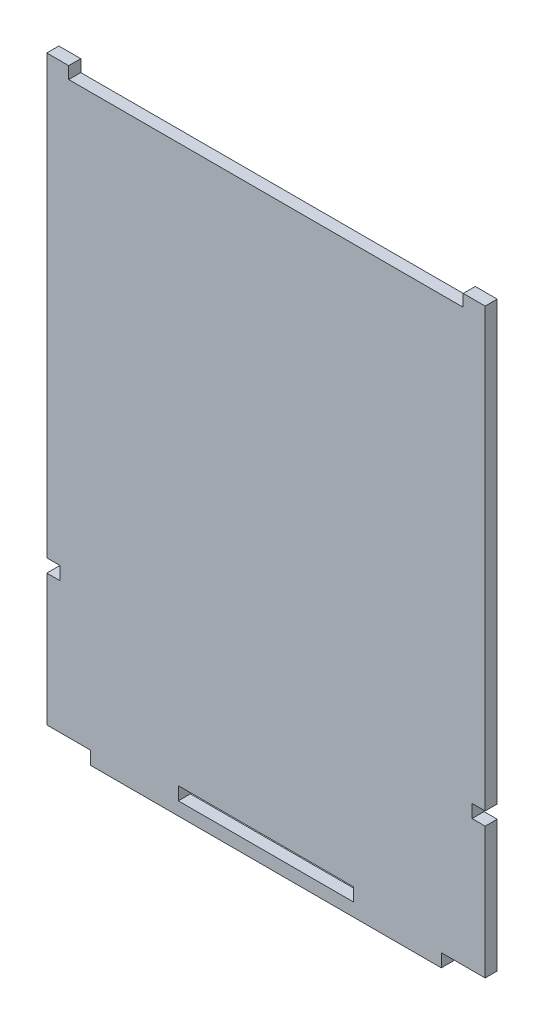
ISO-10303-21;
HEADER;
FILE_DESCRIPTION(('STEP AP214'),'2;1');
FILE_NAME('part.step','',(''),(''),'','','');
FILE_SCHEMA(('AUTOMOTIVE_DESIGN { 1 0 10303 214 1 1 1 1 }'));
ENDSEC;
DATA;
#1=APPLICATION_CONTEXT('core data for automotive mechanical design processes');
#2=APPLICATION_PROTOCOL_DEFINITION('international standard','automotive_design',2000,#1);
#3=PRODUCT_CONTEXT('',#1,'mechanical');
#4=PRODUCT('Part','Part','',(#3));
#5=PRODUCT_RELATED_PRODUCT_CATEGORY('part','',(#4));
#6=PRODUCT_DEFINITION_FORMATION('','',#4);
#7=PRODUCT_DEFINITION_CONTEXT('part definition',#1,'design');
#8=PRODUCT_DEFINITION('design','',#6,#7);
#9=PRODUCT_DEFINITION_SHAPE('','',#8);
#10=(LENGTH_UNIT() NAMED_UNIT(*) SI_UNIT(.MILLI.,.METRE.));
#11=(NAMED_UNIT(*) PLANE_ANGLE_UNIT() SI_UNIT($,.RADIAN.));
#12=(NAMED_UNIT(*) SI_UNIT($,.STERADIAN.) SOLID_ANGLE_UNIT());
#13=UNCERTAINTY_MEASURE_WITH_UNIT(LENGTH_MEASURE(1.E-05),#10,'distance_accuracy_value','');
#14=(GEOMETRIC_REPRESENTATION_CONTEXT(3) GLOBAL_UNCERTAINTY_ASSIGNED_CONTEXT((#13)) GLOBAL_UNIT_ASSIGNED_CONTEXT((#10,
#11,#12)) REPRESENTATION_CONTEXT('',''));
#15=CARTESIAN_POINT('',(0.,0.,0.));
#16=DIRECTION('',(0.,0.,1.));
#17=DIRECTION('',(1.,0.,0.));
#18=AXIS2_PLACEMENT_3D('',#15,#16,#17);
#19=CARTESIAN_POINT('',(70.,0.,2.75));
#20=DIRECTION('',(1.,0.,0.));
#21=DIRECTION('',(0.,0.,-1.));
#22=AXIS2_PLACEMENT_3D('',#19,#20,#21);
#23=PLANE('',#22);
#24=DIRECTION('',(0.,-1.,0.));
#25=VECTOR('',#24,1.);
#26=CARTESIAN_POINT('',(70.,0.,0.));
#27=LINE('',#26,#25);
#28=CARTESIAN_POINT('',(70.,-27.,0.));
#29=VERTEX_POINT('',#28);
#30=CARTESIAN_POINT('',(70.,-30.,0.));
#31=VERTEX_POINT('',#30);
#32=EDGE_CURVE('E280',#29,#31,#27,.T.);
#33=ORIENTED_EDGE('',*,*,#32,.T.);
#34=DIRECTION('',(0.,0.,-1.));
#35=VECTOR('',#34,1.);
#36=CARTESIAN_POINT('',(70.,-30.,2.75));
#37=LINE('',#36,#35);
#38=CARTESIAN_POINT('',(70.,-30.,2.75));
#39=VERTEX_POINT('',#38);
#40=EDGE_CURVE('E11',#39,#31,#37,.T.);
#41=ORIENTED_EDGE('',*,*,#40,.F.);
#42=DIRECTION('',(0.,-1.,0.));
#43=VECTOR('',#42,1.);
#44=CARTESIAN_POINT('',(70.,0.,2.75));
#45=LINE('',#44,#43);
#46=CARTESIAN_POINT('',(70.,-27.,2.75));
#47=VERTEX_POINT('',#46);
#48=EDGE_CURVE('E217',#47,#39,#45,.T.);
#49=ORIENTED_EDGE('',*,*,#48,.F.);
#50=DIRECTION('',(0.,0.,-1.));
#51=VECTOR('',#50,1.);
#52=CARTESIAN_POINT('',(70.,-27.,2.75));
#53=LINE('',#52,#51);
#54=EDGE_CURVE('E54',#47,#29,#53,.T.);
#55=ORIENTED_EDGE('',*,*,#54,.T.);
#56=EDGE_LOOP('',(#33,#41,#49,#55));
#57=FACE_BOUND('',#56,.T.);
#58=ADVANCED_FACE('F35',(#57),#23,.F.);
#59=CARTESIAN_POINT('',(0.,-30.,2.75));
#60=DIRECTION('',(0.,1.,0.));
#61=DIRECTION('',(0.,0.,1.));
#62=AXIS2_PLACEMENT_3D('',#59,#60,#61);
#63=PLANE('',#62);
#64=DIRECTION('',(1.,0.,0.));
#65=VECTOR('',#64,1.);
#66=CARTESIAN_POINT('',(0.,-30.,0.));
#67=LINE('',#66,#65);
#68=CARTESIAN_POINT('',(30.,-30.,0.));
#69=VERTEX_POINT('',#68);
#70=EDGE_CURVE('E207',#69,#31,#67,.T.);
#71=ORIENTED_EDGE('',*,*,#70,.F.);
#72=DIRECTION('',(0.,0.,-1.));
#73=VECTOR('',#72,1.);
#74=CARTESIAN_POINT('',(30.,-30.,2.75));
#75=LINE('',#74,#73);
#76=CARTESIAN_POINT('',(30.,-30.,2.75));
#77=VERTEX_POINT('',#76);
#78=EDGE_CURVE('E45',#77,#69,#75,.T.);
#79=ORIENTED_EDGE('',*,*,#78,.F.);
#80=DIRECTION('',(1.,0.,0.));
#81=VECTOR('',#80,1.);
#82=CARTESIAN_POINT('',(0.,-30.,2.75));
#83=LINE('',#82,#81);
#84=EDGE_CURVE('E205',#77,#39,#83,.T.);
#85=ORIENTED_EDGE('',*,*,#84,.T.);
#86=ORIENTED_EDGE('',*,*,#40,.T.);
#87=EDGE_LOOP('',(#71,#79,#85,#86));
#88=FACE_BOUND('',#87,.T.);
#89=ADVANCED_FACE('F204',(#88),#63,.T.);
#90=CARTESIAN_POINT('',(30.,0.,2.75));
#91=DIRECTION('',(1.,0.,0.));
#92=DIRECTION('',(0.,0.,-1.));
#93=AXIS2_PLACEMENT_3D('',#90,#91,#92);
#94=PLANE('',#93);
#95=DIRECTION('',(0.,-1.,0.));
#96=VECTOR('',#95,1.);
#97=CARTESIAN_POINT('',(30.,0.,0.));
#98=LINE('',#97,#96);
#99=CARTESIAN_POINT('',(30.,-27.,0.));
#100=VERTEX_POINT('',#99);
#101=EDGE_CURVE('E283',#100,#69,#98,.T.);
#102=ORIENTED_EDGE('',*,*,#101,.F.);
#103=DIRECTION('',(0.,0.,-1.));
#104=VECTOR('',#103,1.);
#105=CARTESIAN_POINT('',(30.,-27.,2.75));
#106=LINE('',#105,#104);
#107=CARTESIAN_POINT('',(30.,-27.,2.75));
#108=VERTEX_POINT('',#107);
#109=EDGE_CURVE('E127',#108,#100,#106,.T.);
#110=ORIENTED_EDGE('',*,*,#109,.F.);
#111=DIRECTION('',(0.,-1.,0.));
#112=VECTOR('',#111,1.);
#113=CARTESIAN_POINT('',(30.,0.,2.75));
#114=LINE('',#113,#112);
#115=EDGE_CURVE('E216',#108,#77,#114,.T.);
#116=ORIENTED_EDGE('',*,*,#115,.T.);
#117=ORIENTED_EDGE('',*,*,#78,.T.);
#118=EDGE_LOOP('',(#102,#110,#116,#117));
#119=FACE_BOUND('',#118,.T.);
#120=ADVANCED_FACE('F220',(#119),#94,.T.);
#121=CARTESIAN_POINT('',(90.,0.,2.75));
#122=DIRECTION('',(1.,0.,0.));
#123=DIRECTION('',(0.,0.,-1.));
#124=AXIS2_PLACEMENT_3D('',#121,#122,#123);
#125=PLANE('',#124);
#126=DIRECTION('',(0.,-1.,0.));
#127=VECTOR('',#126,1.);
#128=CARTESIAN_POINT('',(90.,0.,0.));
#129=LINE('',#128,#127);
#130=CARTESIAN_POINT('',(90.,-30.,0.));
#131=VERTEX_POINT('',#130);
#132=CARTESIAN_POINT('',(90.,-33.,0.));
#133=VERTEX_POINT('',#132);
#134=EDGE_CURVE('E227',#131,#133,#129,.T.);
#135=ORIENTED_EDGE('',*,*,#134,.F.);
#136=DIRECTION('',(0.,0.,-1.));
#137=VECTOR('',#136,1.);
#138=CARTESIAN_POINT('',(90.,-30.,2.75));
#139=LINE('',#138,#137);
#140=CARTESIAN_POINT('',(90.,-30.,2.75));
#141=VERTEX_POINT('',#140);
#142=EDGE_CURVE('E39',#141,#131,#139,.T.);
#143=ORIENTED_EDGE('',*,*,#142,.F.);
#144=DIRECTION('',(0.,-1.,0.));
#145=VECTOR('',#144,1.);
#146=CARTESIAN_POINT('',(90.,0.,2.75));
#147=LINE('',#146,#145);
#148=CARTESIAN_POINT('',(90.,-33.,2.75));
#149=VERTEX_POINT('',#148);
#150=EDGE_CURVE('E288',#141,#149,#147,.T.);
#151=ORIENTED_EDGE('',*,*,#150,.T.);
#152=DIRECTION('',(0.,0.,-1.));
#153=VECTOR('',#152,1.);
#154=CARTESIAN_POINT('',(90.,-33.,2.75));
#155=LINE('',#154,#153);
#156=EDGE_CURVE('E223',#149,#133,#155,.T.);
#157=ORIENTED_EDGE('',*,*,#156,.T.);
#158=EDGE_LOOP('',(#135,#143,#151,#157));
#159=FACE_BOUND('',#158,.T.);
#160=ADVANCED_FACE('F37',(#159),#125,.T.);
#161=CARTESIAN_POINT('',(0.,-30.,2.75));
#162=DIRECTION('',(0.,1.,0.));
#163=DIRECTION('',(0.,0.,1.));
#164=AXIS2_PLACEMENT_3D('',#161,#162,#163);
#165=PLANE('',#164);
#166=DIRECTION('',(1.,0.,0.));
#167=VECTOR('',#166,1.);
#168=CARTESIAN_POINT('',(0.,-30.,0.));
#169=LINE('',#168,#167);
#170=CARTESIAN_POINT('',(100.,-30.,0.));
#171=VERTEX_POINT('',#170);
#172=EDGE_CURVE('E230',#131,#171,#169,.T.);
#173=ORIENTED_EDGE('',*,*,#172,.T.);
#174=DIRECTION('',(0.,0.,-1.));
#175=VECTOR('',#174,1.);
#176=CARTESIAN_POINT('',(100.,-30.,2.75));
#177=LINE('',#176,#175);
#178=CARTESIAN_POINT('',(100.,-30.,2.75));
#179=VERTEX_POINT('',#178);
#180=EDGE_CURVE('E330',#179,#171,#177,.T.);
#181=ORIENTED_EDGE('',*,*,#180,.F.);
#182=DIRECTION('',(1.,0.,0.));
#183=VECTOR('',#182,1.);
#184=CARTESIAN_POINT('',(0.,-30.,2.75));
#185=LINE('',#184,#183);
#186=EDGE_CURVE('E338',#141,#179,#185,.T.);
#187=ORIENTED_EDGE('',*,*,#186,.F.);
#188=ORIENTED_EDGE('',*,*,#142,.T.);
#189=EDGE_LOOP('',(#173,#181,#187,#188));
#190=FACE_BOUND('',#189,.T.);
#191=ADVANCED_FACE('F337',(#190),#165,.F.);
#192=CARTESIAN_POINT('',(100.,0.,2.75));
#193=DIRECTION('',(1.,0.,0.));
#194=DIRECTION('',(0.,0.,-1.));
#195=AXIS2_PLACEMENT_3D('',#192,#193,#194);
#196=PLANE('',#195);
#197=DIRECTION('',(0.,-1.,0.));
#198=VECTOR('',#197,1.);
#199=CARTESIAN_POINT('',(100.,0.,0.));
#200=LINE('',#199,#198);
#201=CARTESIAN_POINT('',(100.,0.,0.));
#202=VERTEX_POINT('',#201);
#203=EDGE_CURVE('E233',#202,#171,#200,.T.);
#204=ORIENTED_EDGE('',*,*,#203,.F.);
#205=DIRECTION('',(0.,0.,-1.));
#206=VECTOR('',#205,1.);
#207=CARTESIAN_POINT('',(100.,0.,2.75));
#208=LINE('',#207,#206);
#209=CARTESIAN_POINT('',(100.,0.,2.75));
#210=VERTEX_POINT('',#209);
#211=EDGE_CURVE('E329',#210,#202,#208,.T.);
#212=ORIENTED_EDGE('',*,*,#211,.F.);
#213=DIRECTION('',(0.,-1.,0.));
#214=VECTOR('',#213,1.);
#215=CARTESIAN_POINT('',(100.,0.,2.75));
#216=LINE('',#215,#214);
#217=EDGE_CURVE('E735',#210,#179,#216,.T.);
#218=ORIENTED_EDGE('',*,*,#217,.T.);
#219=ORIENTED_EDGE('',*,*,#180,.T.);
#220=EDGE_LOOP('',(#204,#212,#218,#219));
#221=FACE_BOUND('',#220,.T.);
#222=ADVANCED_FACE('F439',(#221),#196,.T.);
#223=CARTESIAN_POINT('',(0.,0.,2.75));
#224=DIRECTION('',(0.,1.,0.));
#225=DIRECTION('',(0.,0.,1.));
#226=AXIS2_PLACEMENT_3D('',#223,#224,#225);
#227=PLANE('',#226);
#228=DIRECTION('',(1.,0.,0.));
#229=VECTOR('',#228,1.);
#230=CARTESIAN_POINT('',(0.,0.,0.));
#231=LINE('',#230,#229);
#232=CARTESIAN_POINT('',(97.,0.,0.));
#233=VERTEX_POINT('',#232);
#234=EDGE_CURVE('E236',#233,#202,#231,.T.);
#235=ORIENTED_EDGE('',*,*,#234,.F.);
#236=DIRECTION('',(0.,0.,-1.));
#237=VECTOR('',#236,1.);
#238=CARTESIAN_POINT('',(97.,0.,2.75));
#239=LINE('',#238,#237);
#240=CARTESIAN_POINT('',(97.,0.,2.75));
#241=VERTEX_POINT('',#240);
#242=EDGE_CURVE('E327',#241,#233,#239,.T.);
#243=ORIENTED_EDGE('',*,*,#242,.F.);
#244=DIRECTION('',(1.,0.,0.));
#245=VECTOR('',#244,1.);
#246=CARTESIAN_POINT('',(0.,0.,2.75));
#247=LINE('',#246,#245);
#248=EDGE_CURVE('E437',#241,#210,#247,.T.);
#249=ORIENTED_EDGE('',*,*,#248,.T.);
#250=ORIENTED_EDGE('',*,*,#211,.T.);
#251=EDGE_LOOP('',(#235,#243,#249,#250));
#252=FACE_BOUND('',#251,.T.);
#253=ADVANCED_FACE('F433',(#252),#227,.T.);
#254=CARTESIAN_POINT('',(97.,0.,2.75));
#255=DIRECTION('',(-1.,0.,0.));
#256=DIRECTION('',(0.,0.,1.));
#257=AXIS2_PLACEMENT_3D('',#254,#255,#256);
#258=PLANE('',#257);
#259=DIRECTION('',(0.,1.,0.));
#260=VECTOR('',#259,1.);
#261=CARTESIAN_POINT('',(97.,0.,0.));
#262=LINE('',#261,#260);
#263=CARTESIAN_POINT('',(97.,3.,0.));
#264=VERTEX_POINT('',#263);
#265=EDGE_CURVE('E239',#233,#264,#262,.T.);
#266=ORIENTED_EDGE('',*,*,#265,.T.);
#267=DIRECTION('',(0.,0.,-1.));
#268=VECTOR('',#267,1.);
#269=CARTESIAN_POINT('',(97.,3.,2.75));
#270=LINE('',#269,#268);
#271=CARTESIAN_POINT('',(97.,3.,2.75));
#272=VERTEX_POINT('',#271);
#273=EDGE_CURVE('E325',#272,#264,#270,.T.);
#274=ORIENTED_EDGE('',*,*,#273,.F.);
#275=DIRECTION('',(0.,1.,0.));
#276=VECTOR('',#275,1.);
#277=CARTESIAN_POINT('',(97.,0.,2.75));
#278=LINE('',#277,#276);
#279=EDGE_CURVE('E740',#241,#272,#278,.T.);
#280=ORIENTED_EDGE('',*,*,#279,.F.);
#281=ORIENTED_EDGE('',*,*,#242,.T.);
#282=EDGE_LOOP('',(#266,#274,#280,#281));
#283=FACE_BOUND('',#282,.T.);
#284=ADVANCED_FACE('F446',(#283),#258,.F.);
#285=CARTESIAN_POINT('',(0.,3.,2.75));
#286=DIRECTION('',(0.,-1.,0.));
#287=DIRECTION('',(0.,0.,-1.));
#288=AXIS2_PLACEMENT_3D('',#285,#286,#287);
#289=PLANE('',#288);
#290=DIRECTION('',(-1.,0.,0.));
#291=VECTOR('',#290,1.);
#292=CARTESIAN_POINT('',(0.,3.,0.));
#293=LINE('',#292,#291);
#294=CARTESIAN_POINT('',(100.,3.,0.));
#295=VERTEX_POINT('',#294);
#296=EDGE_CURVE('E243',#295,#264,#293,.T.);
#297=ORIENTED_EDGE('',*,*,#296,.F.);
#298=DIRECTION('',(0.,0.,-1.));
#299=VECTOR('',#298,1.);
#300=CARTESIAN_POINT('',(100.,3.,2.75));
#301=LINE('',#300,#299);
#302=CARTESIAN_POINT('',(100.,3.,2.75));
#303=VERTEX_POINT('',#302);
#304=EDGE_CURVE('E323',#303,#295,#301,.T.);
#305=ORIENTED_EDGE('',*,*,#304,.F.);
#306=DIRECTION('',(-1.,0.,0.));
#307=VECTOR('',#306,1.);
#308=CARTESIAN_POINT('',(0.,3.,2.75));
#309=LINE('',#308,#307);
#310=EDGE_CURVE('E427',#303,#272,#309,.T.);
#311=ORIENTED_EDGE('',*,*,#310,.T.);
#312=ORIENTED_EDGE('',*,*,#273,.T.);
#313=EDGE_LOOP('',(#297,#305,#311,#312));
#314=FACE_BOUND('',#313,.T.);
#315=ADVANCED_FACE('F426',(#314),#289,.T.);
#316=CARTESIAN_POINT('',(100.,0.,2.75));
#317=DIRECTION('',(-1.,0.,0.));
#318=DIRECTION('',(0.,0.,1.));
#319=AXIS2_PLACEMENT_3D('',#316,#317,#318);
#320=PLANE('',#319);
#321=DIRECTION('',(0.,1.,0.));
#322=VECTOR('',#321,1.);
#323=CARTESIAN_POINT('',(100.,0.,0.));
#324=LINE('',#323,#322);
#325=CARTESIAN_POINT('',(100.,102.75,0.));
#326=VERTEX_POINT('',#325);
#327=EDGE_CURVE('E246',#295,#326,#324,.T.);
#328=ORIENTED_EDGE('',*,*,#327,.T.);
#329=DIRECTION('',(0.,0.,-1.));
#330=VECTOR('',#329,1.);
#331=CARTESIAN_POINT('',(100.,102.75,2.75));
#332=LINE('',#331,#330);
#333=CARTESIAN_POINT('',(100.,102.75,2.75));
#334=VERTEX_POINT('',#333);
#335=EDGE_CURVE('E320',#334,#326,#332,.T.);
#336=ORIENTED_EDGE('',*,*,#335,.F.);
#337=DIRECTION('',(0.,1.,0.));
#338=VECTOR('',#337,1.);
#339=CARTESIAN_POINT('',(100.,0.,2.75));
#340=LINE('',#339,#338);
#341=EDGE_CURVE('E422',#303,#334,#340,.T.);
#342=ORIENTED_EDGE('',*,*,#341,.F.);
#343=ORIENTED_EDGE('',*,*,#304,.T.);
#344=EDGE_LOOP('',(#328,#336,#342,#343));
#345=FACE_BOUND('',#344,.T.);
#346=ADVANCED_FACE('F421',(#345),#320,.F.);
#347=CARTESIAN_POINT('',(0.,102.75,2.75));
#348=DIRECTION('',(0.,-1.,0.));
#349=DIRECTION('',(0.,0.,-1.));
#350=AXIS2_PLACEMENT_3D('',#347,#348,#349);
#351=PLANE('',#350);
#352=DIRECTION('',(-1.,0.,0.));
#353=VECTOR('',#352,1.);
#354=CARTESIAN_POINT('',(0.,102.75,0.));
#355=LINE('',#354,#353);
#356=CARTESIAN_POINT('',(95.,102.75,0.));
#357=VERTEX_POINT('',#356);
#358=EDGE_CURVE('E248',#326,#357,#355,.T.);
#359=ORIENTED_EDGE('',*,*,#358,.T.);
#360=DIRECTION('',(0.,0.,-1.));
#361=VECTOR('',#360,1.);
#362=CARTESIAN_POINT('',(95.,102.75,2.75));
#363=LINE('',#362,#361);
#364=CARTESIAN_POINT('',(95.,102.75,2.75));
#365=VERTEX_POINT('',#364);
#366=EDGE_CURVE('E317',#365,#357,#363,.T.);
#367=ORIENTED_EDGE('',*,*,#366,.F.);
#368=DIRECTION('',(-1.,0.,0.));
#369=VECTOR('',#368,1.);
#370=CARTESIAN_POINT('',(0.,102.75,2.75));
#371=LINE('',#370,#369);
#372=EDGE_CURVE('E418',#334,#365,#371,.T.);
#373=ORIENTED_EDGE('',*,*,#372,.F.);
#374=ORIENTED_EDGE('',*,*,#335,.T.);
#375=EDGE_LOOP('',(#359,#367,#373,#374));
#376=FACE_BOUND('',#375,.T.);
#377=ADVANCED_FACE('F415',(#376),#351,.F.);
#378=CARTESIAN_POINT('',(95.,0.,2.75));
#379=DIRECTION('',(1.,0.,0.));
#380=DIRECTION('',(0.,0.,-1.));
#381=AXIS2_PLACEMENT_3D('',#378,#379,#380);
#382=PLANE('',#381);
#383=DIRECTION('',(0.,-1.,0.));
#384=VECTOR('',#383,1.);
#385=CARTESIAN_POINT('',(95.,0.,0.));
#386=LINE('',#385,#384);
#387=CARTESIAN_POINT('',(95.,100.,0.));
#388=VERTEX_POINT('',#387);
#389=EDGE_CURVE('E250',#357,#388,#386,.T.);
#390=ORIENTED_EDGE('',*,*,#389,.T.);
#391=DIRECTION('',(0.,0.,-1.));
#392=VECTOR('',#391,1.);
#393=CARTESIAN_POINT('',(95.,100.,2.75));
#394=LINE('',#393,#392);
#395=CARTESIAN_POINT('',(95.,100.,2.75));
#396=VERTEX_POINT('',#395);
#397=EDGE_CURVE('E315',#396,#388,#394,.T.);
#398=ORIENTED_EDGE('',*,*,#397,.F.);
#399=DIRECTION('',(0.,-1.,0.));
#400=VECTOR('',#399,1.);
#401=CARTESIAN_POINT('',(95.,0.,2.75));
#402=LINE('',#401,#400);
#403=EDGE_CURVE('E745',#365,#396,#402,.T.);
#404=ORIENTED_EDGE('',*,*,#403,.F.);
#405=ORIENTED_EDGE('',*,*,#366,.T.);
#406=EDGE_LOOP('',(#390,#398,#404,#405));
#407=FACE_BOUND('',#406,.T.);
#408=ADVANCED_FACE('F409',(#407),#382,.F.);
#409=CARTESIAN_POINT('',(0.,100.,2.75));
#410=DIRECTION('',(0.,1.,0.));
#411=DIRECTION('',(0.,0.,1.));
#412=AXIS2_PLACEMENT_3D('',#409,#410,#411);
#413=PLANE('',#412);
#414=DIRECTION('',(1.,0.,0.));
#415=VECTOR('',#414,1.);
#416=CARTESIAN_POINT('',(0.,100.,0.));
#417=LINE('',#416,#415);
#418=CARTESIAN_POINT('',(5.,100.,0.));
#419=VERTEX_POINT('',#418);
#420=EDGE_CURVE('E253',#419,#388,#417,.T.);
#421=ORIENTED_EDGE('',*,*,#420,.F.);
#422=DIRECTION('',(0.,0.,-1.));
#423=VECTOR('',#422,1.);
#424=CARTESIAN_POINT('',(5.,100.,2.75));
#425=LINE('',#424,#423);
#426=CARTESIAN_POINT('',(5.,100.,2.75));
#427=VERTEX_POINT('',#426);
#428=EDGE_CURVE('E313',#427,#419,#425,.T.);
#429=ORIENTED_EDGE('',*,*,#428,.F.);
#430=DIRECTION('',(1.,0.,0.));
#431=VECTOR('',#430,1.);
#432=CARTESIAN_POINT('',(0.,100.,2.75));
#433=LINE('',#432,#431);
#434=EDGE_CURVE('E406',#427,#396,#433,.T.);
#435=ORIENTED_EDGE('',*,*,#434,.T.);
#436=ORIENTED_EDGE('',*,*,#397,.T.);
#437=EDGE_LOOP('',(#421,#429,#435,#436));
#438=FACE_BOUND('',#437,.T.);
#439=ADVANCED_FACE('F404',(#438),#413,.T.);
#440=CARTESIAN_POINT('',(5.,0.,2.75));
#441=DIRECTION('',(1.,0.,0.));
#442=DIRECTION('',(0.,0.,-1.));
#443=AXIS2_PLACEMENT_3D('',#440,#441,#442);
#444=PLANE('',#443);
#445=DIRECTION('',(0.,-1.,0.));
#446=VECTOR('',#445,1.);
#447=CARTESIAN_POINT('',(5.,0.,0.));
#448=LINE('',#447,#446);
#449=CARTESIAN_POINT('',(5.,102.75,0.));
#450=VERTEX_POINT('',#449);
#451=EDGE_CURVE('E256',#450,#419,#448,.T.);
#452=ORIENTED_EDGE('',*,*,#451,.F.);
#453=DIRECTION('',(0.,0.,-1.));
#454=VECTOR('',#453,1.);
#455=CARTESIAN_POINT('',(5.,102.75,2.75));
#456=LINE('',#455,#454);
#457=CARTESIAN_POINT('',(5.,102.75,2.75));
#458=VERTEX_POINT('',#457);
#459=EDGE_CURVE('E311',#458,#450,#456,.T.);
#460=ORIENTED_EDGE('',*,*,#459,.F.);
#461=DIRECTION('',(0.,-1.,0.));
#462=VECTOR('',#461,1.);
#463=CARTESIAN_POINT('',(5.,0.,2.75));
#464=LINE('',#463,#462);
#465=EDGE_CURVE('E400',#458,#427,#464,.T.);
#466=ORIENTED_EDGE('',*,*,#465,.T.);
#467=ORIENTED_EDGE('',*,*,#428,.T.);
#468=EDGE_LOOP('',(#452,#460,#466,#467));
#469=FACE_BOUND('',#468,.T.);
#470=ADVANCED_FACE('F397',(#469),#444,.T.);
#471=CARTESIAN_POINT('',(0.,102.75,2.75));
#472=DIRECTION('',(0.,1.,0.));
#473=DIRECTION('',(0.,0.,1.));
#474=AXIS2_PLACEMENT_3D('',#471,#472,#473);
#475=PLANE('',#474);
#476=DIRECTION('',(1.,0.,0.));
#477=VECTOR('',#476,1.);
#478=CARTESIAN_POINT('',(0.,102.75,0.));
#479=LINE('',#478,#477);
#480=CARTESIAN_POINT('',(0.,102.75,0.));
#481=VERTEX_POINT('',#480);
#482=EDGE_CURVE('E259',#481,#450,#479,.T.);
#483=ORIENTED_EDGE('',*,*,#482,.F.);
#484=DIRECTION('',(0.,0.,-1.));
#485=VECTOR('',#484,1.);
#486=CARTESIAN_POINT('',(0.,102.75,2.75));
#487=LINE('',#486,#485);
#488=CARTESIAN_POINT('',(0.,102.75,2.75));
#489=VERTEX_POINT('',#488);
#490=EDGE_CURVE('E309',#489,#481,#487,.T.);
#491=ORIENTED_EDGE('',*,*,#490,.F.);
#492=DIRECTION('',(1.,0.,0.));
#493=VECTOR('',#492,1.);
#494=CARTESIAN_POINT('',(0.,102.75,2.75));
#495=LINE('',#494,#493);
#496=EDGE_CURVE('E749',#489,#458,#495,.T.);
#497=ORIENTED_EDGE('',*,*,#496,.T.);
#498=ORIENTED_EDGE('',*,*,#459,.T.);
#499=EDGE_LOOP('',(#483,#491,#497,#498));
#500=FACE_BOUND('',#499,.T.);
#501=ADVANCED_FACE('F392',(#500),#475,.T.);
#502=CARTESIAN_POINT('',(0.,0.,2.75));
#503=DIRECTION('',(-1.,0.,0.));
#504=DIRECTION('',(0.,0.,1.));
#505=AXIS2_PLACEMENT_3D('',#502,#503,#504);
#506=PLANE('',#505);
#507=DIRECTION('',(0.,1.,0.));
#508=VECTOR('',#507,1.);
#509=CARTESIAN_POINT('',(0.,0.,0.));
#510=LINE('',#509,#508);
#511=CARTESIAN_POINT('',(0.,3.,0.));
#512=VERTEX_POINT('',#511);
#513=EDGE_CURVE('E262',#512,#481,#510,.T.);
#514=ORIENTED_EDGE('',*,*,#513,.F.);
#515=DIRECTION('',(0.,0.,-1.));
#516=VECTOR('',#515,1.);
#517=CARTESIAN_POINT('',(0.,3.,2.75));
#518=LINE('',#517,#516);
#519=CARTESIAN_POINT('',(0.,3.,2.75));
#520=VERTEX_POINT('',#519);
#521=EDGE_CURVE('E307',#520,#512,#518,.T.);
#522=ORIENTED_EDGE('',*,*,#521,.F.);
#523=DIRECTION('',(0.,1.,0.));
#524=VECTOR('',#523,1.);
#525=CARTESIAN_POINT('',(0.,0.,2.75));
#526=LINE('',#525,#524);
#527=EDGE_CURVE('E388',#520,#489,#526,.T.);
#528=ORIENTED_EDGE('',*,*,#527,.T.);
#529=ORIENTED_EDGE('',*,*,#490,.T.);
#530=EDGE_LOOP('',(#514,#522,#528,#529));
#531=FACE_BOUND('',#530,.T.);
#532=ADVANCED_FACE('F383',(#531),#506,.T.);
#533=CARTESIAN_POINT('',(0.,3.,2.75));
#534=DIRECTION('',(0.,1.,0.));
#535=DIRECTION('',(0.,0.,1.));
#536=AXIS2_PLACEMENT_3D('',#533,#534,#535);
#537=PLANE('',#536);
#538=DIRECTION('',(1.,0.,0.));
#539=VECTOR('',#538,1.);
#540=CARTESIAN_POINT('',(0.,3.,0.));
#541=LINE('',#540,#539);
#542=CARTESIAN_POINT('',(3.,3.,0.));
#543=VERTEX_POINT('',#542);
#544=EDGE_CURVE('E265',#512,#543,#541,.T.);
#545=ORIENTED_EDGE('',*,*,#544,.T.);
#546=DIRECTION('',(0.,0.,-1.));
#547=VECTOR('',#546,1.);
#548=CARTESIAN_POINT('',(3.,3.,2.75));
#549=LINE('',#548,#547);
#550=CARTESIAN_POINT('',(3.,3.,2.75));
#551=VERTEX_POINT('',#550);
#552=EDGE_CURVE('E305',#551,#543,#549,.T.);
#553=ORIENTED_EDGE('',*,*,#552,.F.);
#554=DIRECTION('',(1.,0.,0.));
#555=VECTOR('',#554,1.);
#556=CARTESIAN_POINT('',(0.,3.,2.75));
#557=LINE('',#556,#555);
#558=EDGE_CURVE('E752',#520,#551,#557,.T.);
#559=ORIENTED_EDGE('',*,*,#558,.F.);
#560=ORIENTED_EDGE('',*,*,#521,.T.);
#561=EDGE_LOOP('',(#545,#553,#559,#560));
#562=FACE_BOUND('',#561,.T.);
#563=ADVANCED_FACE('F469',(#562),#537,.F.);
#564=CARTESIAN_POINT('',(3.,0.,2.75));
#565=DIRECTION('',(-1.,0.,0.));
#566=DIRECTION('',(0.,0.,1.));
#567=AXIS2_PLACEMENT_3D('',#564,#565,#566);
#568=PLANE('',#567);
#569=DIRECTION('',(0.,1.,0.));
#570=VECTOR('',#569,1.);
#571=CARTESIAN_POINT('',(3.,0.,0.));
#572=LINE('',#571,#570);
#573=CARTESIAN_POINT('',(3.,0.,0.));
#574=VERTEX_POINT('',#573);
#575=EDGE_CURVE('E268',#574,#543,#572,.T.);
#576=ORIENTED_EDGE('',*,*,#575,.F.);
#577=DIRECTION('',(0.,0.,-1.));
#578=VECTOR('',#577,1.);
#579=CARTESIAN_POINT('',(3.,0.,2.75));
#580=LINE('',#579,#578);
#581=CARTESIAN_POINT('',(3.,0.,2.75));
#582=VERTEX_POINT('',#581);
#583=EDGE_CURVE('E303',#582,#574,#580,.T.);
#584=ORIENTED_EDGE('',*,*,#583,.F.);
#585=DIRECTION('',(0.,1.,0.));
#586=VECTOR('',#585,1.);
#587=CARTESIAN_POINT('',(3.,0.,2.75));
#588=LINE('',#587,#586);
#589=EDGE_CURVE('E754',#582,#551,#588,.T.);
#590=ORIENTED_EDGE('',*,*,#589,.T.);
#591=ORIENTED_EDGE('',*,*,#552,.T.);
#592=EDGE_LOOP('',(#576,#584,#590,#591));
#593=FACE_BOUND('',#592,.T.);
#594=ADVANCED_FACE('F377',(#593),#568,.T.);
#595=CARTESIAN_POINT('',(0.,0.,0.));
#596=VERTEX_POINT('',#595);
#597=EDGE_CURVE('E240',#596,#574,#231,.T.);
#598=ORIENTED_EDGE('',*,*,#597,.F.);
#599=DIRECTION('',(0.,0.,-1.));
#600=VECTOR('',#599,1.);
#601=CARTESIAN_POINT('',(0.,0.,2.75));
#602=LINE('',#601,#600);
#603=CARTESIAN_POINT('',(0.,0.,2.75));
#604=VERTEX_POINT('',#603);
#605=EDGE_CURVE('E301',#604,#596,#602,.T.);
#606=ORIENTED_EDGE('',*,*,#605,.F.);
#607=EDGE_CURVE('E373',#604,#582,#247,.T.);
#608=ORIENTED_EDGE('',*,*,#607,.T.);
#609=ORIENTED_EDGE('',*,*,#583,.T.);
#610=EDGE_LOOP('',(#598,#606,#608,#609));
#611=FACE_BOUND('',#610,.T.);
#612=ADVANCED_FACE('F370',(#611),#227,.T.);
#613=CARTESIAN_POINT('',(0.,0.,2.75));
#614=DIRECTION('',(1.,0.,0.));
#615=DIRECTION('',(0.,0.,-1.));
#616=AXIS2_PLACEMENT_3D('',#613,#614,#615);
#617=PLANE('',#616);
#618=DIRECTION('',(0.,-1.,0.));
#619=VECTOR('',#618,1.);
#620=CARTESIAN_POINT('',(0.,0.,0.));
#621=LINE('',#620,#619);
#622=CARTESIAN_POINT('',(0.,-30.,0.));
#623=VERTEX_POINT('',#622);
#624=EDGE_CURVE('E271',#596,#623,#621,.T.);
#625=ORIENTED_EDGE('',*,*,#624,.T.);
#626=DIRECTION('',(0.,0.,-1.));
#627=VECTOR('',#626,1.);
#628=CARTESIAN_POINT('',(0.,-30.,2.75));
#629=LINE('',#628,#627);
#630=CARTESIAN_POINT('',(0.,-30.,2.75));
#631=VERTEX_POINT('',#630);
#632=EDGE_CURVE('E298',#631,#623,#629,.T.);
#633=ORIENTED_EDGE('',*,*,#632,.F.);
#634=DIRECTION('',(0.,-1.,0.));
#635=VECTOR('',#634,1.);
#636=CARTESIAN_POINT('',(0.,0.,2.75));
#637=LINE('',#636,#635);
#638=EDGE_CURVE('E365',#604,#631,#637,.T.);
#639=ORIENTED_EDGE('',*,*,#638,.F.);
#640=ORIENTED_EDGE('',*,*,#605,.T.);
#641=EDGE_LOOP('',(#625,#633,#639,#640));
#642=FACE_BOUND('',#641,.T.);
#643=ADVANCED_FACE('F364',(#642),#617,.F.);
#644=CARTESIAN_POINT('',(0.,-30.,2.75));
#645=DIRECTION('',(0.,1.,0.));
#646=DIRECTION('',(0.,0.,1.));
#647=AXIS2_PLACEMENT_3D('',#644,#645,#646);
#648=PLANE('',#647);
#649=DIRECTION('',(1.,0.,0.));
#650=VECTOR('',#649,1.);
#651=CARTESIAN_POINT('',(0.,-30.,0.));
#652=LINE('',#651,#650);
#653=CARTESIAN_POINT('',(10.,-30.,0.));
#654=VERTEX_POINT('',#653);
#655=EDGE_CURVE('E273',#623,#654,#652,.T.);
#656=ORIENTED_EDGE('',*,*,#655,.T.);
#657=DIRECTION('',(0.,0.,-1.));
#658=VECTOR('',#657,1.);
#659=CARTESIAN_POINT('',(10.,-30.,2.75));
#660=LINE('',#659,#658);
#661=CARTESIAN_POINT('',(10.,-30.,2.75));
#662=VERTEX_POINT('',#661);
#663=EDGE_CURVE('E295',#662,#654,#660,.T.);
#664=ORIENTED_EDGE('',*,*,#663,.F.);
#665=DIRECTION('',(1.,0.,0.));
#666=VECTOR('',#665,1.);
#667=CARTESIAN_POINT('',(0.,-30.,2.75));
#668=LINE('',#667,#666);
#669=EDGE_CURVE('E360',#631,#662,#668,.T.);
#670=ORIENTED_EDGE('',*,*,#669,.F.);
#671=ORIENTED_EDGE('',*,*,#632,.T.);
#672=EDGE_LOOP('',(#656,#664,#670,#671));
#673=FACE_BOUND('',#672,.T.);
#674=ADVANCED_FACE('F359',(#673),#648,.F.);
#675=CARTESIAN_POINT('',(10.,0.,2.75));
#676=DIRECTION('',(1.,0.,0.));
#677=DIRECTION('',(0.,0.,-1.));
#678=AXIS2_PLACEMENT_3D('',#675,#676,#677);
#679=PLANE('',#678);
#680=DIRECTION('',(0.,-1.,0.));
#681=VECTOR('',#680,1.);
#682=CARTESIAN_POINT('',(10.,0.,0.));
#683=LINE('',#682,#681);
#684=CARTESIAN_POINT('',(10.,-33.,0.));
#685=VERTEX_POINT('',#684);
#686=EDGE_CURVE('E275',#654,#685,#683,.T.);
#687=ORIENTED_EDGE('',*,*,#686,.T.);
#688=DIRECTION('',(0.,0.,-1.));
#689=VECTOR('',#688,1.);
#690=CARTESIAN_POINT('',(10.,-33.,2.75));
#691=LINE('',#690,#689);
#692=CARTESIAN_POINT('',(10.,-33.,2.75));
#693=VERTEX_POINT('',#692);
#694=EDGE_CURVE('E292',#693,#685,#691,.T.);
#695=ORIENTED_EDGE('',*,*,#694,.F.);
#696=DIRECTION('',(0.,-1.,0.));
#697=VECTOR('',#696,1.);
#698=CARTESIAN_POINT('',(10.,0.,2.75));
#699=LINE('',#698,#697);
#700=EDGE_CURVE('E356',#662,#693,#699,.T.);
#701=ORIENTED_EDGE('',*,*,#700,.F.);
#702=ORIENTED_EDGE('',*,*,#663,.T.);
#703=EDGE_LOOP('',(#687,#695,#701,#702));
#704=FACE_BOUND('',#703,.T.);
#705=ADVANCED_FACE('F353',(#704),#679,.F.);
#706=CARTESIAN_POINT('',(0.,-33.,2.75));
#707=DIRECTION('',(0.,1.,0.));
#708=DIRECTION('',(0.,0.,1.));
#709=AXIS2_PLACEMENT_3D('',#706,#707,#708);
#710=PLANE('',#709);
#711=DIRECTION('',(1.,0.,0.));
#712=VECTOR('',#711,1.);
#713=CARTESIAN_POINT('',(0.,-33.,0.));
#714=LINE('',#713,#712);
#715=EDGE_CURVE('E277',#685,#133,#714,.T.);
#716=ORIENTED_EDGE('',*,*,#715,.T.);
#717=ORIENTED_EDGE('',*,*,#156,.F.);
#718=DIRECTION('',(1.,0.,0.));
#719=VECTOR('',#718,1.);
#720=CARTESIAN_POINT('',(0.,-33.,2.75));
#721=LINE('',#720,#719);
#722=EDGE_CURVE('E733',#693,#149,#721,.T.);
#723=ORIENTED_EDGE('',*,*,#722,.F.);
#724=ORIENTED_EDGE('',*,*,#694,.T.);
#725=EDGE_LOOP('',(#716,#717,#723,#724));
#726=FACE_BOUND('',#725,.T.);
#727=ADVANCED_FACE('F347',(#726),#710,.F.);
#728=CARTESIAN_POINT('',(0.,-27.,2.75));
#729=DIRECTION('',(0.,-1.,0.));
#730=DIRECTION('',(0.,0.,-1.));
#731=AXIS2_PLACEMENT_3D('',#728,#729,#730);
#732=PLANE('',#731);
#733=DIRECTION('',(-1.,0.,0.));
#734=VECTOR('',#733,1.);
#735=CARTESIAN_POINT('',(0.,-27.,0.));
#736=LINE('',#735,#734);
#737=EDGE_CURVE('E285',#29,#100,#736,.T.);
#738=ORIENTED_EDGE('',*,*,#737,.F.);
#739=ORIENTED_EDGE('',*,*,#54,.F.);
#740=DIRECTION('',(-1.,0.,0.));
#741=VECTOR('',#740,1.);
#742=CARTESIAN_POINT('',(0.,-27.,2.75));
#743=LINE('',#742,#741);
#744=EDGE_CURVE('E221',#47,#108,#743,.T.);
#745=ORIENTED_EDGE('',*,*,#744,.T.);
#746=ORIENTED_EDGE('',*,*,#109,.T.);
#747=EDGE_LOOP('',(#738,#739,#745,#746));
#748=FACE_BOUND('',#747,.T.);
#749=ADVANCED_FACE('F459',(#748),#732,.T.);
#750=CARTESIAN_POINT('',(0.,0.,2.75));
#751=DIRECTION('',(0.,0.,1.));
#752=DIRECTION('',(1.,0.,0.));
#753=AXIS2_PLACEMENT_3D('',#750,#751,#752);
#754=PLANE('',#753);
#755=ORIENTED_EDGE('',*,*,#150,.F.);
#756=ORIENTED_EDGE('',*,*,#186,.T.);
#757=ORIENTED_EDGE('',*,*,#217,.F.);
#758=ORIENTED_EDGE('',*,*,#248,.F.);
#759=ORIENTED_EDGE('',*,*,#279,.T.);
#760=ORIENTED_EDGE('',*,*,#310,.F.);
#761=ORIENTED_EDGE('',*,*,#341,.T.);
#762=ORIENTED_EDGE('',*,*,#372,.T.);
#763=ORIENTED_EDGE('',*,*,#403,.T.);
#764=ORIENTED_EDGE('',*,*,#434,.F.);
#765=ORIENTED_EDGE('',*,*,#465,.F.);
#766=ORIENTED_EDGE('',*,*,#496,.F.);
#767=ORIENTED_EDGE('',*,*,#527,.F.);
#768=ORIENTED_EDGE('',*,*,#558,.T.);
#769=ORIENTED_EDGE('',*,*,#589,.F.);
#770=ORIENTED_EDGE('',*,*,#607,.F.);
#771=ORIENTED_EDGE('',*,*,#638,.T.);
#772=ORIENTED_EDGE('',*,*,#669,.T.);
#773=ORIENTED_EDGE('',*,*,#700,.T.);
#774=ORIENTED_EDGE('',*,*,#722,.T.);
#775=EDGE_LOOP('',(#755,#756,#757,#758,#759,#760,#761,#762,#763,#764,#765,#766,#767,#768,#769,
#770,#771,#772,#773,#774));
#776=FACE_BOUND('',#775,.T.);
#777=ORIENTED_EDGE('',*,*,#48,.T.);
#778=ORIENTED_EDGE('',*,*,#84,.F.);
#779=ORIENTED_EDGE('',*,*,#115,.F.);
#780=ORIENTED_EDGE('',*,*,#744,.F.);
#781=EDGE_LOOP('',(#777,#778,#779,#780));
#782=FACE_BOUND('',#781,.T.);
#783=ADVANCED_FACE('F214',(#776,#782),#754,.T.);
#784=CARTESIAN_POINT('',(0.,0.,0.));
#785=DIRECTION('',(0.,0.,1.));
#786=DIRECTION('',(1.,0.,0.));
#787=AXIS2_PLACEMENT_3D('',#784,#785,#786);
#788=PLANE('',#787);
#789=ORIENTED_EDGE('',*,*,#134,.T.);
#790=ORIENTED_EDGE('',*,*,#715,.F.);
#791=ORIENTED_EDGE('',*,*,#686,.F.);
#792=ORIENTED_EDGE('',*,*,#655,.F.);
#793=ORIENTED_EDGE('',*,*,#624,.F.);
#794=ORIENTED_EDGE('',*,*,#597,.T.);
#795=ORIENTED_EDGE('',*,*,#575,.T.);
#796=ORIENTED_EDGE('',*,*,#544,.F.);
#797=ORIENTED_EDGE('',*,*,#513,.T.);
#798=ORIENTED_EDGE('',*,*,#482,.T.);
#799=ORIENTED_EDGE('',*,*,#451,.T.);
#800=ORIENTED_EDGE('',*,*,#420,.T.);
#801=ORIENTED_EDGE('',*,*,#389,.F.);
#802=ORIENTED_EDGE('',*,*,#358,.F.);
#803=ORIENTED_EDGE('',*,*,#327,.F.);
#804=ORIENTED_EDGE('',*,*,#296,.T.);
#805=ORIENTED_EDGE('',*,*,#265,.F.);
#806=ORIENTED_EDGE('',*,*,#234,.T.);
#807=ORIENTED_EDGE('',*,*,#203,.T.);
#808=ORIENTED_EDGE('',*,*,#172,.F.);
#809=EDGE_LOOP('',(#789,#790,#791,#792,#793,#794,#795,#796,#797,#798,#799,#800,#801,#802,#803,
#804,#805,#806,#807,#808));
#810=FACE_BOUND('',#809,.T.);
#811=ORIENTED_EDGE('',*,*,#32,.F.);
#812=ORIENTED_EDGE('',*,*,#737,.T.);
#813=ORIENTED_EDGE('',*,*,#101,.T.);
#814=ORIENTED_EDGE('',*,*,#70,.T.);
#815=EDGE_LOOP('',(#811,#812,#813,#814));
#816=FACE_BOUND('',#815,.T.);
#817=ADVANCED_FACE('F341',(#810,#816),#788,.F.);
#818=CLOSED_SHELL('',(#58,#89,#120,#160,#191,#222,#253,#284,#315,#346,#377,#408,#439,#470,#501,
#532,#563,#594,#612,#643,#674,#705,#727,#749,#783,#817));
#819=MANIFOLD_SOLID_BREP('B2',#818);
#820=ADVANCED_BREP_SHAPE_REPRESENTATION('',(#18,#819),#14);
#821=SHAPE_DEFINITION_REPRESENTATION(#9,#820);
ENDSEC;
END-ISO-10303-21;
